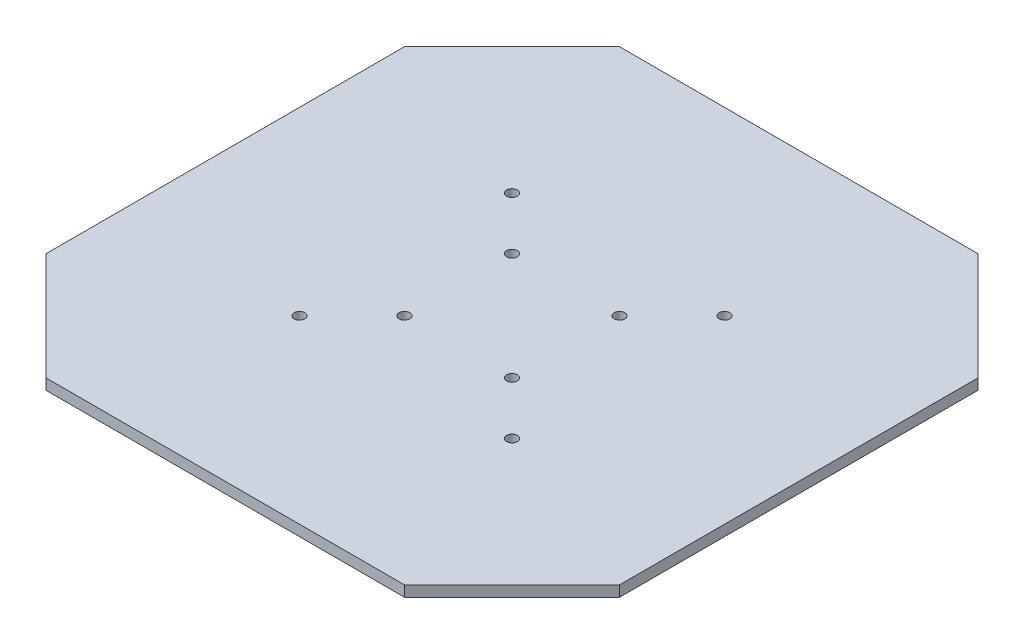
ISO-10303-21;
HEADER;
FILE_DESCRIPTION(('STEP AP214'),'2;1');
FILE_NAME('part.step','',(''),(''),'','','');
FILE_SCHEMA(('AUTOMOTIVE_DESIGN { 1 0 10303 214 1 1 1 1 }'));
ENDSEC;
DATA;
#1=APPLICATION_CONTEXT('core data for automotive mechanical design processes');
#2=APPLICATION_PROTOCOL_DEFINITION('international standard','automotive_design',2000,#1);
#3=PRODUCT_CONTEXT('',#1,'mechanical');
#4=PRODUCT('Part','Part','',(#3));
#5=PRODUCT_RELATED_PRODUCT_CATEGORY('part','',(#4));
#6=PRODUCT_DEFINITION_FORMATION('','',#4);
#7=PRODUCT_DEFINITION_CONTEXT('part definition',#1,'design');
#8=PRODUCT_DEFINITION('design','',#6,#7);
#9=PRODUCT_DEFINITION_SHAPE('','',#8);
#10=(LENGTH_UNIT() NAMED_UNIT(*) SI_UNIT(.MILLI.,.METRE.));
#11=(NAMED_UNIT(*) PLANE_ANGLE_UNIT() SI_UNIT($,.RADIAN.));
#12=(NAMED_UNIT(*) SI_UNIT($,.STERADIAN.) SOLID_ANGLE_UNIT());
#13=UNCERTAINTY_MEASURE_WITH_UNIT(LENGTH_MEASURE(1.E-05),#10,'distance_accuracy_value','');
#14=(GEOMETRIC_REPRESENTATION_CONTEXT(3) GLOBAL_UNCERTAINTY_ASSIGNED_CONTEXT((#13)) GLOBAL_UNIT_ASSIGNED_CONTEXT((#10,
#11,#12)) REPRESENTATION_CONTEXT('',''));
#15=CARTESIAN_POINT('',(0.,0.,0.));
#16=DIRECTION('',(0.,0.,1.));
#17=DIRECTION('',(1.,0.,0.));
#18=AXIS2_PLACEMENT_3D('',#15,#16,#17);
#19=CARTESIAN_POINT('',(30.,3.,-160.));
#20=DIRECTION('',(0.,0.,1.));
#21=DIRECTION('',(1.,0.,0.));
#22=AXIS2_PLACEMENT_3D('',#19,#20,#21);
#23=PLANE('',#22);
#24=DIRECTION('',(-1.,0.,0.));
#25=VECTOR('',#24,1.);
#26=CARTESIAN_POINT('',(30.,0.,-160.));
#27=LINE('',#26,#25);
#28=CARTESIAN_POINT('',(130.,0.,-160.));
#29=VERTEX_POINT('',#28);
#30=CARTESIAN_POINT('',(30.,0.,-160.));
#31=VERTEX_POINT('',#30);
#32=EDGE_CURVE('E133',#29,#31,#27,.T.);
#33=ORIENTED_EDGE('',*,*,#32,.T.);
#34=DIRECTION('',(0.,-1.,0.));
#35=VECTOR('',#34,1.);
#36=CARTESIAN_POINT('',(30.,3.,-160.));
#37=LINE('',#36,#35);
#38=CARTESIAN_POINT('',(30.,3.,-160.));
#39=VERTEX_POINT('',#38);
#40=EDGE_CURVE('E11',#39,#31,#37,.T.);
#41=ORIENTED_EDGE('',*,*,#40,.F.);
#42=DIRECTION('',(-1.,0.,0.));
#43=VECTOR('',#42,1.);
#44=CARTESIAN_POINT('',(30.,3.,-160.));
#45=LINE('',#44,#43);
#46=CARTESIAN_POINT('',(130.,3.,-160.));
#47=VERTEX_POINT('',#46);
#48=EDGE_CURVE('E148',#47,#39,#45,.T.);
#49=ORIENTED_EDGE('',*,*,#48,.F.);
#50=DIRECTION('',(0.,-1.,0.));
#51=VECTOR('',#50,1.);
#52=CARTESIAN_POINT('',(130.,3.,-160.));
#53=LINE('',#52,#51);
#54=EDGE_CURVE('E129',#47,#29,#53,.T.);
#55=ORIENTED_EDGE('',*,*,#54,.T.);
#56=EDGE_LOOP('',(#33,#41,#49,#55));
#57=FACE_BOUND('',#56,.T.);
#58=ADVANCED_FACE('F37',(#57),#23,.F.);
#59=CARTESIAN_POINT('',(0.,3.,-130.));
#60=DIRECTION('',(0.707106781186548,0.,0.707106781186548));
#61=DIRECTION('',(0.707106781186548,0.,-0.707106781186548));
#62=AXIS2_PLACEMENT_3D('',#59,#60,#61);
#63=PLANE('',#62);
#64=DIRECTION('',(-0.707106781186547,0.,0.707106781186547));
#65=VECTOR('',#64,1.);
#66=CARTESIAN_POINT('',(0.,0.,-130.));
#67=LINE('',#66,#65);
#68=CARTESIAN_POINT('',(0.,0.,-130.));
#69=VERTEX_POINT('',#68);
#70=EDGE_CURVE('E136',#31,#69,#67,.T.);
#71=ORIENTED_EDGE('',*,*,#70,.T.);
#72=DIRECTION('',(0.,-1.,0.));
#73=VECTOR('',#72,1.);
#74=CARTESIAN_POINT('',(0.,3.,-130.));
#75=LINE('',#74,#73);
#76=CARTESIAN_POINT('',(0.,3.,-130.));
#77=VERTEX_POINT('',#76);
#78=EDGE_CURVE('E45',#77,#69,#75,.T.);
#79=ORIENTED_EDGE('',*,*,#78,.F.);
#80=DIRECTION('',(-0.707106781186547,0.,0.707106781186547));
#81=VECTOR('',#80,1.);
#82=CARTESIAN_POINT('',(0.,3.,-130.));
#83=LINE('',#82,#81);
#84=EDGE_CURVE('E96',#39,#77,#83,.T.);
#85=ORIENTED_EDGE('',*,*,#84,.F.);
#86=ORIENTED_EDGE('',*,*,#40,.T.);
#87=EDGE_LOOP('',(#71,#79,#85,#86));
#88=FACE_BOUND('',#87,.T.);
#89=ADVANCED_FACE('F255',(#88),#63,.F.);
#90=CARTESIAN_POINT('',(0.,3.,-30.));
#91=DIRECTION('',(1.,0.,0.));
#92=DIRECTION('',(0.,0.,-1.));
#93=AXIS2_PLACEMENT_3D('',#90,#91,#92);
#94=PLANE('',#93);
#95=DIRECTION('',(0.,0.,1.));
#96=VECTOR('',#95,1.);
#97=CARTESIAN_POINT('',(0.,0.,-30.));
#98=LINE('',#97,#96);
#99=CARTESIAN_POINT('',(0.,0.,-30.));
#100=VERTEX_POINT('',#99);
#101=EDGE_CURVE('E139',#69,#100,#98,.T.);
#102=ORIENTED_EDGE('',*,*,#101,.T.);
#103=DIRECTION('',(0.,-1.,0.));
#104=VECTOR('',#103,1.);
#105=CARTESIAN_POINT('',(0.,3.,-30.));
#106=LINE('',#105,#104);
#107=CARTESIAN_POINT('',(0.,3.,-30.));
#108=VERTEX_POINT('',#107);
#109=EDGE_CURVE('E155',#108,#100,#106,.T.);
#110=ORIENTED_EDGE('',*,*,#109,.F.);
#111=DIRECTION('',(0.,0.,1.));
#112=VECTOR('',#111,1.);
#113=CARTESIAN_POINT('',(0.,3.,-30.));
#114=LINE('',#113,#112);
#115=EDGE_CURVE('E163',#77,#108,#114,.T.);
#116=ORIENTED_EDGE('',*,*,#115,.F.);
#117=ORIENTED_EDGE('',*,*,#78,.T.);
#118=EDGE_LOOP('',(#102,#110,#116,#117));
#119=FACE_BOUND('',#118,.T.);
#120=ADVANCED_FACE('F161',(#119),#94,.F.);
#121=CARTESIAN_POINT('',(30.,3.,0.));
#122=DIRECTION('',(0.707106781186548,0.,-0.707106781186548));
#123=DIRECTION('',(-0.707106781186548,0.,-0.707106781186548));
#124=AXIS2_PLACEMENT_3D('',#121,#122,#123);
#125=PLANE('',#124);
#126=DIRECTION('',(0.707106781186547,0.,0.707106781186547));
#127=VECTOR('',#126,1.);
#128=CARTESIAN_POINT('',(30.,0.,0.));
#129=LINE('',#128,#127);
#130=CARTESIAN_POINT('',(30.,0.,0.));
#131=VERTEX_POINT('',#130);
#132=EDGE_CURVE('E141',#100,#131,#129,.T.);
#133=ORIENTED_EDGE('',*,*,#132,.T.);
#134=DIRECTION('',(0.,-1.,0.));
#135=VECTOR('',#134,1.);
#136=CARTESIAN_POINT('',(30.,3.,0.));
#137=LINE('',#136,#135);
#138=CARTESIAN_POINT('',(30.,3.,0.));
#139=VERTEX_POINT('',#138);
#140=EDGE_CURVE('E152',#139,#131,#137,.T.);
#141=ORIENTED_EDGE('',*,*,#140,.F.);
#142=DIRECTION('',(0.707106781186547,0.,0.707106781186547));
#143=VECTOR('',#142,1.);
#144=CARTESIAN_POINT('',(30.,3.,0.));
#145=LINE('',#144,#143);
#146=EDGE_CURVE('E175',#108,#139,#145,.T.);
#147=ORIENTED_EDGE('',*,*,#146,.F.);
#148=ORIENTED_EDGE('',*,*,#109,.T.);
#149=EDGE_LOOP('',(#133,#141,#147,#148));
#150=FACE_BOUND('',#149,.T.);
#151=ADVANCED_FACE('F171',(#150),#125,.F.);
#152=CARTESIAN_POINT('',(30.,3.,0.));
#153=DIRECTION('',(0.,0.,-1.));
#154=DIRECTION('',(-1.,0.,0.));
#155=AXIS2_PLACEMENT_3D('',#152,#153,#154);
#156=PLANE('',#155);
#157=DIRECTION('',(1.,0.,0.));
#158=VECTOR('',#157,1.);
#159=CARTESIAN_POINT('',(30.,0.,0.));
#160=LINE('',#159,#158);
#161=CARTESIAN_POINT('',(130.,0.,0.));
#162=VERTEX_POINT('',#161);
#163=EDGE_CURVE('E143',#131,#162,#160,.T.);
#164=ORIENTED_EDGE('',*,*,#163,.T.);
#165=DIRECTION('',(0.,-1.,0.));
#166=VECTOR('',#165,1.);
#167=CARTESIAN_POINT('',(130.,3.,0.));
#168=LINE('',#167,#166);
#169=CARTESIAN_POINT('',(130.,3.,0.));
#170=VERTEX_POINT('',#169);
#171=EDGE_CURVE('E124',#170,#162,#168,.T.);
#172=ORIENTED_EDGE('',*,*,#171,.F.);
#173=DIRECTION('',(1.,0.,0.));
#174=VECTOR('',#173,1.);
#175=CARTESIAN_POINT('',(30.,3.,0.));
#176=LINE('',#175,#174);
#177=EDGE_CURVE('E115',#139,#170,#176,.T.);
#178=ORIENTED_EDGE('',*,*,#177,.F.);
#179=ORIENTED_EDGE('',*,*,#140,.T.);
#180=EDGE_LOOP('',(#164,#172,#178,#179));
#181=FACE_BOUND('',#180,.T.);
#182=ADVANCED_FACE('F174',(#181),#156,.F.);
#183=CARTESIAN_POINT('',(130.,3.,0.));
#184=DIRECTION('',(-0.707106781186548,0.,-0.707106781186548));
#185=DIRECTION('',(-0.707106781186548,0.,0.707106781186548));
#186=AXIS2_PLACEMENT_3D('',#183,#184,#185);
#187=PLANE('',#186);
#188=DIRECTION('',(0.707106781186547,0.,-0.707106781186547));
#189=VECTOR('',#188,1.);
#190=CARTESIAN_POINT('',(130.,0.,0.));
#191=LINE('',#190,#189);
#192=CARTESIAN_POINT('',(160.,0.,-30.));
#193=VERTEX_POINT('',#192);
#194=EDGE_CURVE('E123',#162,#193,#191,.T.);
#195=ORIENTED_EDGE('',*,*,#194,.T.);
#196=DIRECTION('',(0.,-1.,0.));
#197=VECTOR('',#196,1.);
#198=CARTESIAN_POINT('',(160.,3.,-30.));
#199=LINE('',#198,#197);
#200=CARTESIAN_POINT('',(160.,3.,-30.));
#201=VERTEX_POINT('',#200);
#202=EDGE_CURVE('E120',#201,#193,#199,.T.);
#203=ORIENTED_EDGE('',*,*,#202,.F.);
#204=DIRECTION('',(0.707106781186547,0.,-0.707106781186547));
#205=VECTOR('',#204,1.);
#206=CARTESIAN_POINT('',(130.,3.,0.));
#207=LINE('',#206,#205);
#208=EDGE_CURVE('E109',#170,#201,#207,.T.);
#209=ORIENTED_EDGE('',*,*,#208,.F.);
#210=ORIENTED_EDGE('',*,*,#171,.T.);
#211=EDGE_LOOP('',(#195,#203,#209,#210));
#212=FACE_BOUND('',#211,.T.);
#213=ADVANCED_FACE('F121',(#212),#187,.F.);
#214=CARTESIAN_POINT('',(160.,3.,-30.));
#215=DIRECTION('',(-1.,0.,0.));
#216=DIRECTION('',(0.,0.,1.));
#217=AXIS2_PLACEMENT_3D('',#214,#215,#216);
#218=PLANE('',#217);
#219=DIRECTION('',(0.,0.,-1.));
#220=VECTOR('',#219,1.);
#221=CARTESIAN_POINT('',(160.,0.,-30.));
#222=LINE('',#221,#220);
#223=CARTESIAN_POINT('',(160.,0.,-130.));
#224=VERTEX_POINT('',#223);
#225=EDGE_CURVE('E82',#193,#224,#222,.T.);
#226=ORIENTED_EDGE('',*,*,#225,.T.);
#227=DIRECTION('',(0.,-1.,0.));
#228=VECTOR('',#227,1.);
#229=CARTESIAN_POINT('',(160.,3.,-130.));
#230=LINE('',#229,#228);
#231=CARTESIAN_POINT('',(160.,3.,-130.));
#232=VERTEX_POINT('',#231);
#233=EDGE_CURVE('E125',#232,#224,#230,.T.);
#234=ORIENTED_EDGE('',*,*,#233,.F.);
#235=DIRECTION('',(0.,0.,-1.));
#236=VECTOR('',#235,1.);
#237=CARTESIAN_POINT('',(160.,3.,-30.));
#238=LINE('',#237,#236);
#239=EDGE_CURVE('E113',#201,#232,#238,.T.);
#240=ORIENTED_EDGE('',*,*,#239,.F.);
#241=ORIENTED_EDGE('',*,*,#202,.T.);
#242=EDGE_LOOP('',(#226,#234,#240,#241));
#243=FACE_BOUND('',#242,.T.);
#244=ADVANCED_FACE('F127',(#243),#218,.F.);
#245=CARTESIAN_POINT('',(130.,3.,-160.));
#246=DIRECTION('',(-0.707106781186548,0.,0.707106781186548));
#247=DIRECTION('',(0.707106781186548,0.,0.707106781186548));
#248=AXIS2_PLACEMENT_3D('',#245,#246,#247);
#249=PLANE('',#248);
#250=DIRECTION('',(-0.707106781186547,0.,-0.707106781186547));
#251=VECTOR('',#250,1.);
#252=CARTESIAN_POINT('',(130.,0.,-160.));
#253=LINE('',#252,#251);
#254=EDGE_CURVE('E88',#224,#29,#253,.T.);
#255=ORIENTED_EDGE('',*,*,#254,.T.);
#256=ORIENTED_EDGE('',*,*,#54,.F.);
#257=DIRECTION('',(-0.707106781186547,0.,-0.707106781186547));
#258=VECTOR('',#257,1.);
#259=CARTESIAN_POINT('',(130.,3.,-160.));
#260=LINE('',#259,#258);
#261=EDGE_CURVE('E53',#232,#47,#260,.T.);
#262=ORIENTED_EDGE('',*,*,#261,.F.);
#263=ORIENTED_EDGE('',*,*,#233,.T.);
#264=EDGE_LOOP('',(#255,#256,#262,#263));
#265=FACE_BOUND('',#264,.T.);
#266=ADVANCED_FACE('F262',(#265),#249,.F.);
#267=CARTESIAN_POINT('',(0.,3.,0.));
#268=DIRECTION('',(0.,1.,0.));
#269=DIRECTION('',(0.,0.,1.));
#270=AXIS2_PLACEMENT_3D('',#267,#268,#269);
#271=PLANE('',#270);
#272=CARTESIAN_POINT('',(109.644660940673,3.,-50.3553390593274));
#273=DIRECTION('',(0.,1.,0.));
#274=DIRECTION('',(0.,0.,1.));
#275=AXIS2_PLACEMENT_3D('',#272,#273,#274);
#276=CIRCLE('',#275,1.5);
#277=CARTESIAN_POINT('',(109.644660940673,3.,-48.8553390593274));
#278=VERTEX_POINT('',#277);
#279=EDGE_CURVE('E137',#278,#278,#276,.T.);
#280=ORIENTED_EDGE('',*,*,#279,.F.);
#281=EDGE_LOOP('',(#280));
#282=FACE_BOUND('',#281,.T.);
#283=CARTESIAN_POINT('',(109.644660940673,3.,-109.644660940673));
#284=DIRECTION('',(0.,1.,0.));
#285=DIRECTION('',(0.,0.,1.));
#286=AXIS2_PLACEMENT_3D('',#283,#284,#285);
#287=CIRCLE('',#286,1.5);
#288=CARTESIAN_POINT('',(109.644660940673,3.,-108.144660940673));
#289=VERTEX_POINT('',#288);
#290=EDGE_CURVE('E183',#289,#289,#287,.T.);
#291=ORIENTED_EDGE('',*,*,#290,.F.);
#292=EDGE_LOOP('',(#291));
#293=FACE_BOUND('',#292,.T.);
#294=CARTESIAN_POINT('',(50.3553390593274,3.,-109.644660940673));
#295=DIRECTION('',(0.,1.,0.));
#296=DIRECTION('',(0.,0.,1.));
#297=AXIS2_PLACEMENT_3D('',#294,#295,#296);
#298=CIRCLE('',#297,1.5);
#299=CARTESIAN_POINT('',(50.3553390593274,3.,-108.144660940673));
#300=VERTEX_POINT('',#299);
#301=EDGE_CURVE('E186',#300,#300,#298,.T.);
#302=ORIENTED_EDGE('',*,*,#301,.F.);
#303=EDGE_LOOP('',(#302));
#304=FACE_BOUND('',#303,.T.);
#305=CARTESIAN_POINT('',(65.,3.,-95.));
#306=DIRECTION('',(0.,1.,0.));
#307=DIRECTION('',(0.,0.,1.));
#308=AXIS2_PLACEMENT_3D('',#305,#306,#307);
#309=CIRCLE('',#308,1.5);
#310=CARTESIAN_POINT('',(65.,3.,-93.5));
#311=VERTEX_POINT('',#310);
#312=EDGE_CURVE('E189',#311,#311,#309,.T.);
#313=ORIENTED_EDGE('',*,*,#312,.F.);
#314=EDGE_LOOP('',(#313));
#315=FACE_BOUND('',#314,.T.);
#316=CARTESIAN_POINT('',(95.,3.,-65.));
#317=DIRECTION('',(0.,1.,0.));
#318=DIRECTION('',(0.,0.,1.));
#319=AXIS2_PLACEMENT_3D('',#316,#317,#318);
#320=CIRCLE('',#319,1.5);
#321=CARTESIAN_POINT('',(95.,3.,-63.5));
#322=VERTEX_POINT('',#321);
#323=EDGE_CURVE('E192',#322,#322,#320,.T.);
#324=ORIENTED_EDGE('',*,*,#323,.F.);
#325=EDGE_LOOP('',(#324));
#326=FACE_BOUND('',#325,.T.);
#327=CARTESIAN_POINT('',(65.,3.,-65.));
#328=DIRECTION('',(0.,1.,0.));
#329=DIRECTION('',(0.,0.,1.));
#330=AXIS2_PLACEMENT_3D('',#327,#328,#329);
#331=CIRCLE('',#330,1.5);
#332=CARTESIAN_POINT('',(65.,3.,-63.5));
#333=VERTEX_POINT('',#332);
#334=EDGE_CURVE('E195',#333,#333,#331,.T.);
#335=ORIENTED_EDGE('',*,*,#334,.F.);
#336=EDGE_LOOP('',(#335));
#337=FACE_BOUND('',#336,.T.);
#338=CARTESIAN_POINT('',(95.,3.,-95.));
#339=DIRECTION('',(0.,1.,0.));
#340=DIRECTION('',(0.,0.,1.));
#341=AXIS2_PLACEMENT_3D('',#338,#339,#340);
#342=CIRCLE('',#341,1.5);
#343=CARTESIAN_POINT('',(95.,3.,-93.5));
#344=VERTEX_POINT('',#343);
#345=EDGE_CURVE('E198',#344,#344,#342,.T.);
#346=ORIENTED_EDGE('',*,*,#345,.F.);
#347=EDGE_LOOP('',(#346));
#348=FACE_BOUND('',#347,.T.);
#349=CARTESIAN_POINT('',(50.3553390593274,3.,-50.3553390593273));
#350=DIRECTION('',(0.,1.,0.));
#351=DIRECTION('',(0.,0.,1.));
#352=AXIS2_PLACEMENT_3D('',#349,#350,#351);
#353=CIRCLE('',#352,1.5);
#354=CARTESIAN_POINT('',(50.3553390593274,3.,-48.8553390593273));
#355=VERTEX_POINT('',#354);
#356=EDGE_CURVE('E201',#355,#355,#353,.T.);
#357=ORIENTED_EDGE('',*,*,#356,.F.);
#358=EDGE_LOOP('',(#357));
#359=FACE_BOUND('',#358,.T.);
#360=ORIENTED_EDGE('',*,*,#48,.T.);
#361=ORIENTED_EDGE('',*,*,#84,.T.);
#362=ORIENTED_EDGE('',*,*,#115,.T.);
#363=ORIENTED_EDGE('',*,*,#146,.T.);
#364=ORIENTED_EDGE('',*,*,#177,.T.);
#365=ORIENTED_EDGE('',*,*,#208,.T.);
#366=ORIENTED_EDGE('',*,*,#239,.T.);
#367=ORIENTED_EDGE('',*,*,#261,.T.);
#368=EDGE_LOOP('',(#360,#361,#362,#363,#364,#365,#366,#367));
#369=FACE_BOUND('',#368,.T.);
#370=ADVANCED_FACE('F111',(#282,#293,#304,#315,#326,#337,#348,#359,#369),#271,.T.);
#371=CARTESIAN_POINT('',(0.,0.,0.));
#372=DIRECTION('',(0.,1.,0.));
#373=DIRECTION('',(0.,0.,1.));
#374=AXIS2_PLACEMENT_3D('',#371,#372,#373);
#375=PLANE('',#374);
#376=CARTESIAN_POINT('',(109.644660940673,0.,-50.3553390593274));
#377=DIRECTION('',(0.,-1.,0.));
#378=DIRECTION('',(0.,0.,-1.));
#379=AXIS2_PLACEMENT_3D('',#376,#377,#378);
#380=CIRCLE('',#379,1.5);
#381=CARTESIAN_POINT('',(109.644660940673,0.,-51.8553390593274));
#382=VERTEX_POINT('',#381);
#383=EDGE_CURVE('E207',#382,#382,#380,.T.);
#384=ORIENTED_EDGE('',*,*,#383,.F.);
#385=EDGE_LOOP('',(#384));
#386=FACE_BOUND('',#385,.T.);
#387=CARTESIAN_POINT('',(109.644660940673,0.,-109.644660940673));
#388=DIRECTION('',(0.,-1.,0.));
#389=DIRECTION('',(0.,0.,-1.));
#390=AXIS2_PLACEMENT_3D('',#387,#388,#389);
#391=CIRCLE('',#390,1.5);
#392=CARTESIAN_POINT('',(109.644660940673,0.,-111.144660940673));
#393=VERTEX_POINT('',#392);
#394=EDGE_CURVE('E215',#393,#393,#391,.T.);
#395=ORIENTED_EDGE('',*,*,#394,.F.);
#396=EDGE_LOOP('',(#395));
#397=FACE_BOUND('',#396,.T.);
#398=CARTESIAN_POINT('',(50.3553390593274,0.,-109.644660940673));
#399=DIRECTION('',(0.,-1.,0.));
#400=DIRECTION('',(0.,0.,-1.));
#401=AXIS2_PLACEMENT_3D('',#398,#399,#400);
#402=CIRCLE('',#401,1.5);
#403=CARTESIAN_POINT('',(50.3553390593274,0.,-111.144660940673));
#404=VERTEX_POINT('',#403);
#405=EDGE_CURVE('E211',#404,#404,#402,.T.);
#406=ORIENTED_EDGE('',*,*,#405,.F.);
#407=EDGE_LOOP('',(#406));
#408=FACE_BOUND('',#407,.T.);
#409=CARTESIAN_POINT('',(65.,0.,-95.));
#410=DIRECTION('',(0.,-1.,0.));
#411=DIRECTION('',(0.,0.,-1.));
#412=AXIS2_PLACEMENT_3D('',#409,#410,#411);
#413=CIRCLE('',#412,1.5);
#414=CARTESIAN_POINT('',(65.,0.,-96.5));
#415=VERTEX_POINT('',#414);
#416=EDGE_CURVE('E208',#415,#415,#413,.T.);
#417=ORIENTED_EDGE('',*,*,#416,.F.);
#418=EDGE_LOOP('',(#417));
#419=FACE_BOUND('',#418,.T.);
#420=CARTESIAN_POINT('',(95.,0.,-65.));
#421=DIRECTION('',(0.,-1.,0.));
#422=DIRECTION('',(0.,0.,-1.));
#423=AXIS2_PLACEMENT_3D('',#420,#421,#422);
#424=CIRCLE('',#423,1.5);
#425=CARTESIAN_POINT('',(95.,0.,-66.5));
#426=VERTEX_POINT('',#425);
#427=EDGE_CURVE('E223',#426,#426,#424,.T.);
#428=ORIENTED_EDGE('',*,*,#427,.F.);
#429=EDGE_LOOP('',(#428));
#430=FACE_BOUND('',#429,.T.);
#431=CARTESIAN_POINT('',(65.,0.,-65.));
#432=DIRECTION('',(0.,-1.,0.));
#433=DIRECTION('',(0.,0.,-1.));
#434=AXIS2_PLACEMENT_3D('',#431,#432,#433);
#435=CIRCLE('',#434,1.5);
#436=CARTESIAN_POINT('',(65.,0.,-66.5));
#437=VERTEX_POINT('',#436);
#438=EDGE_CURVE('E220',#437,#437,#435,.T.);
#439=ORIENTED_EDGE('',*,*,#438,.F.);
#440=EDGE_LOOP('',(#439));
#441=FACE_BOUND('',#440,.T.);
#442=CARTESIAN_POINT('',(95.,0.,-95.));
#443=DIRECTION('',(0.,-1.,0.));
#444=DIRECTION('',(0.,0.,-1.));
#445=AXIS2_PLACEMENT_3D('',#442,#443,#444);
#446=CIRCLE('',#445,1.5);
#447=CARTESIAN_POINT('',(95.,0.,-96.5));
#448=VERTEX_POINT('',#447);
#449=EDGE_CURVE('E212',#448,#448,#446,.T.);
#450=ORIENTED_EDGE('',*,*,#449,.F.);
#451=EDGE_LOOP('',(#450));
#452=FACE_BOUND('',#451,.T.);
#453=CARTESIAN_POINT('',(50.3553390593274,0.,-50.3553390593273));
#454=DIRECTION('',(0.,-1.,0.));
#455=DIRECTION('',(0.,0.,-1.));
#456=AXIS2_PLACEMENT_3D('',#453,#454,#455);
#457=CIRCLE('',#456,1.5);
#458=CARTESIAN_POINT('',(50.3553390593274,0.,-51.8553390593273));
#459=VERTEX_POINT('',#458);
#460=EDGE_CURVE('E204',#459,#459,#457,.T.);
#461=ORIENTED_EDGE('',*,*,#460,.F.);
#462=EDGE_LOOP('',(#461));
#463=FACE_BOUND('',#462,.T.);
#464=ORIENTED_EDGE('',*,*,#32,.F.);
#465=ORIENTED_EDGE('',*,*,#254,.F.);
#466=ORIENTED_EDGE('',*,*,#225,.F.);
#467=ORIENTED_EDGE('',*,*,#194,.F.);
#468=ORIENTED_EDGE('',*,*,#163,.F.);
#469=ORIENTED_EDGE('',*,*,#132,.F.);
#470=ORIENTED_EDGE('',*,*,#101,.F.);
#471=ORIENTED_EDGE('',*,*,#70,.F.);
#472=EDGE_LOOP('',(#464,#465,#466,#467,#468,#469,#470,#471));
#473=FACE_BOUND('',#472,.T.);
#474=ADVANCED_FACE('F167',(#386,#397,#408,#419,#430,#441,#452,#463,#473),#375,.F.);
#475=CARTESIAN_POINT('',(50.3553390593274,10.,-50.3553390593273));
#476=DIRECTION('',(0.,-1.,0.));
#477=DIRECTION('',(0.,0.,-1.));
#478=AXIS2_PLACEMENT_3D('',#475,#476,#477);
#479=CYLINDRICAL_SURFACE('',#478,1.5);
#480=ORIENTED_EDGE('',*,*,#356,.T.);
#481=EDGE_LOOP('',(#480));
#482=FACE_BOUND('',#481,.T.);
#483=ORIENTED_EDGE('',*,*,#460,.T.);
#484=EDGE_LOOP('',(#483));
#485=FACE_BOUND('',#484,.T.);
#486=ADVANCED_FACE('F233',(#482,#485),#479,.F.);
#487=CARTESIAN_POINT('',(95.,10.,-95.));
#488=DIRECTION('',(0.,-1.,0.));
#489=DIRECTION('',(0.,0.,-1.));
#490=AXIS2_PLACEMENT_3D('',#487,#488,#489);
#491=CYLINDRICAL_SURFACE('',#490,1.5);
#492=ORIENTED_EDGE('',*,*,#345,.T.);
#493=EDGE_LOOP('',(#492));
#494=FACE_BOUND('',#493,.T.);
#495=ORIENTED_EDGE('',*,*,#449,.T.);
#496=EDGE_LOOP('',(#495));
#497=FACE_BOUND('',#496,.T.);
#498=ADVANCED_FACE('F243',(#494,#497),#491,.F.);
#499=CARTESIAN_POINT('',(65.,10.,-65.));
#500=DIRECTION('',(0.,-1.,0.));
#501=DIRECTION('',(0.,0.,-1.));
#502=AXIS2_PLACEMENT_3D('',#499,#500,#501);
#503=CYLINDRICAL_SURFACE('',#502,1.5);
#504=ORIENTED_EDGE('',*,*,#334,.T.);
#505=EDGE_LOOP('',(#504));
#506=FACE_BOUND('',#505,.T.);
#507=ORIENTED_EDGE('',*,*,#438,.T.);
#508=EDGE_LOOP('',(#507));
#509=FACE_BOUND('',#508,.T.);
#510=ADVANCED_FACE('F249',(#506,#509),#503,.F.);
#511=CARTESIAN_POINT('',(95.,10.,-65.));
#512=DIRECTION('',(0.,-1.,0.));
#513=DIRECTION('',(0.,0.,-1.));
#514=AXIS2_PLACEMENT_3D('',#511,#512,#513);
#515=CYLINDRICAL_SURFACE('',#514,1.5);
#516=ORIENTED_EDGE('',*,*,#323,.T.);
#517=EDGE_LOOP('',(#516));
#518=FACE_BOUND('',#517,.T.);
#519=ORIENTED_EDGE('',*,*,#427,.T.);
#520=EDGE_LOOP('',(#519));
#521=FACE_BOUND('',#520,.T.);
#522=ADVANCED_FACE('F229',(#518,#521),#515,.F.);
#523=CARTESIAN_POINT('',(65.,10.,-95.));
#524=DIRECTION('',(0.,-1.,0.));
#525=DIRECTION('',(0.,0.,-1.));
#526=AXIS2_PLACEMENT_3D('',#523,#524,#525);
#527=CYLINDRICAL_SURFACE('',#526,1.5);
#528=ORIENTED_EDGE('',*,*,#312,.T.);
#529=EDGE_LOOP('',(#528));
#530=FACE_BOUND('',#529,.T.);
#531=ORIENTED_EDGE('',*,*,#416,.T.);
#532=EDGE_LOOP('',(#531));
#533=FACE_BOUND('',#532,.T.);
#534=ADVANCED_FACE('F343',(#530,#533),#527,.F.);
#535=CARTESIAN_POINT('',(50.3553390593274,10.,-109.644660940673));
#536=DIRECTION('',(0.,-1.,0.));
#537=DIRECTION('',(0.,0.,-1.));
#538=AXIS2_PLACEMENT_3D('',#535,#536,#537);
#539=CYLINDRICAL_SURFACE('',#538,1.5);
#540=ORIENTED_EDGE('',*,*,#301,.T.);
#541=EDGE_LOOP('',(#540));
#542=FACE_BOUND('',#541,.T.);
#543=ORIENTED_EDGE('',*,*,#405,.T.);
#544=EDGE_LOOP('',(#543));
#545=FACE_BOUND('',#544,.T.);
#546=ADVANCED_FACE('F353',(#542,#545),#539,.F.);
#547=CARTESIAN_POINT('',(109.644660940673,10.,-109.644660940673));
#548=DIRECTION('',(0.,-1.,0.));
#549=DIRECTION('',(0.,0.,-1.));
#550=AXIS2_PLACEMENT_3D('',#547,#548,#549);
#551=CYLINDRICAL_SURFACE('',#550,1.5);
#552=ORIENTED_EDGE('',*,*,#290,.T.);
#553=EDGE_LOOP('',(#552));
#554=FACE_BOUND('',#553,.T.);
#555=ORIENTED_EDGE('',*,*,#394,.T.);
#556=EDGE_LOOP('',(#555));
#557=FACE_BOUND('',#556,.T.);
#558=ADVANCED_FACE('F362',(#554,#557),#551,.F.);
#559=CARTESIAN_POINT('',(109.644660940673,10.,-50.3553390593274));
#560=DIRECTION('',(0.,-1.,0.));
#561=DIRECTION('',(0.,0.,-1.));
#562=AXIS2_PLACEMENT_3D('',#559,#560,#561);
#563=CYLINDRICAL_SURFACE('',#562,1.5);
#564=ORIENTED_EDGE('',*,*,#279,.T.);
#565=EDGE_LOOP('',(#564));
#566=FACE_BOUND('',#565,.T.);
#567=ORIENTED_EDGE('',*,*,#383,.T.);
#568=EDGE_LOOP('',(#567));
#569=FACE_BOUND('',#568,.T.);
#570=ADVANCED_FACE('F372',(#566,#569),#563,.F.);
#571=CLOSED_SHELL('',(#58,#89,#120,#151,#182,#213,#244,#266,#370,#474,#486,#498,#510,#522,#534,
#546,#558,#570));
#572=MANIFOLD_SOLID_BREP('B2',#571);
#573=ADVANCED_BREP_SHAPE_REPRESENTATION('',(#18,#572),#14);
#574=SHAPE_DEFINITION_REPRESENTATION(#9,#573);
ENDSEC;
END-ISO-10303-21;
